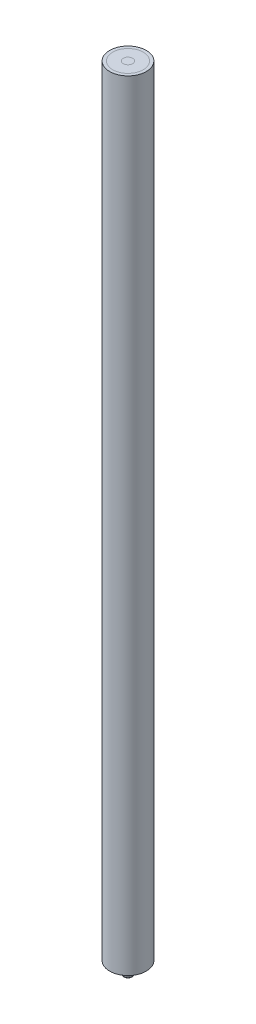
ISO-10303-21;
HEADER;
FILE_DESCRIPTION(('STEP AP214'),'2;1');
FILE_NAME('part.step','',(''),(''),'','','');
FILE_SCHEMA(('AUTOMOTIVE_DESIGN { 1 0 10303 214 1 1 1 1 }'));
ENDSEC;
DATA;
#1=APPLICATION_CONTEXT('core data for automotive mechanical design processes');
#2=APPLICATION_PROTOCOL_DEFINITION('international standard','automotive_design',2000,#1);
#3=PRODUCT_CONTEXT('',#1,'mechanical');
#4=PRODUCT('Part','Part','',(#3));
#5=PRODUCT_RELATED_PRODUCT_CATEGORY('part','',(#4));
#6=PRODUCT_DEFINITION_FORMATION('','',#4);
#7=PRODUCT_DEFINITION_CONTEXT('part definition',#1,'design');
#8=PRODUCT_DEFINITION('design','',#6,#7);
#9=PRODUCT_DEFINITION_SHAPE('','',#8);
#10=(LENGTH_UNIT() NAMED_UNIT(*) SI_UNIT(.MILLI.,.METRE.));
#11=(NAMED_UNIT(*) PLANE_ANGLE_UNIT() SI_UNIT($,.RADIAN.));
#12=(NAMED_UNIT(*) SI_UNIT($,.STERADIAN.) SOLID_ANGLE_UNIT());
#13=UNCERTAINTY_MEASURE_WITH_UNIT(LENGTH_MEASURE(1.E-05),#10,'distance_accuracy_value','');
#14=(GEOMETRIC_REPRESENTATION_CONTEXT(3) GLOBAL_UNCERTAINTY_ASSIGNED_CONTEXT((#13)) GLOBAL_UNIT_ASSIGNED_CONTEXT((#10,
#11,#12)) REPRESENTATION_CONTEXT('',''));
#15=CARTESIAN_POINT('',(0.,0.,0.));
#16=DIRECTION('',(0.,0.,1.));
#17=DIRECTION('',(1.,0.,0.));
#18=AXIS2_PLACEMENT_3D('',#15,#16,#17);
#19=CARTESIAN_POINT('',(0.,76.2,0.));
#20=DIRECTION('',(0.,1.,0.));
#21=DIRECTION('',(0.,0.,1.));
#22=AXIS2_PLACEMENT_3D('',#19,#20,#21);
#23=PLANE('',#22);
#24=CARTESIAN_POINT('',(0.,76.2,0.));
#25=DIRECTION('',(0.,1.,0.));
#26=DIRECTION('',(0.,0.,1.));
#27=AXIS2_PLACEMENT_3D('',#24,#25,#26);
#28=CIRCLE('',#27,1.7907);
#29=CARTESIAN_POINT('',(0.,76.2,1.7907));
#30=VERTEX_POINT('',#29);
#31=EDGE_CURVE('E11',#30,#30,#28,.T.);
#32=ORIENTED_EDGE('',*,*,#31,.T.);
#33=EDGE_LOOP('',(#32));
#34=FACE_BOUND('',#33,.T.);
#35=CARTESIAN_POINT('',(0.,76.2,0.));
#36=DIRECTION('',(0.,1.,0.));
#37=DIRECTION('',(0.,0.,1.));
#38=AXIS2_PLACEMENT_3D('',#35,#36,#37);
#39=CIRCLE('',#38,1.49225);
#40=CARTESIAN_POINT('',(0.,76.2,1.49225));
#41=VERTEX_POINT('',#40);
#42=EDGE_CURVE('E57',#41,#41,#39,.T.);
#43=ORIENTED_EDGE('',*,*,#42,.F.);
#44=EDGE_LOOP('',(#43));
#45=FACE_BOUND('',#44,.T.);
#46=ADVANCED_FACE('F46',(#34,#45),#23,.T.);
#47=CARTESIAN_POINT('',(0.,0.,0.));
#48=DIRECTION('',(0.,1.,0.));
#49=DIRECTION('',(0.,0.,1.));
#50=AXIS2_PLACEMENT_3D('',#47,#48,#49);
#51=PLANE('',#50);
#52=CARTESIAN_POINT('',(0.,0.,0.));
#53=DIRECTION('',(0.,1.,0.));
#54=DIRECTION('',(0.,0.,1.));
#55=AXIS2_PLACEMENT_3D('',#52,#53,#54);
#56=CIRCLE('',#55,1.7907);
#57=CARTESIAN_POINT('',(0.,0.,1.7907));
#58=VERTEX_POINT('',#57);
#59=EDGE_CURVE('E50',#58,#58,#56,.T.);
#60=ORIENTED_EDGE('',*,*,#59,.F.);
#61=EDGE_LOOP('',(#60));
#62=FACE_BOUND('',#61,.T.);
#63=CARTESIAN_POINT('',(0.,0.,0.));
#64=DIRECTION('',(0.,1.,0.));
#65=DIRECTION('',(0.,0.,1.));
#66=AXIS2_PLACEMENT_3D('',#63,#64,#65);
#67=CIRCLE('',#66,1.49225);
#68=CARTESIAN_POINT('',(0.,0.,1.49225));
#69=VERTEX_POINT('',#68);
#70=EDGE_CURVE('E59',#69,#69,#67,.T.);
#71=ORIENTED_EDGE('',*,*,#70,.T.);
#72=EDGE_LOOP('',(#71));
#73=FACE_BOUND('',#72,.T.);
#74=ADVANCED_FACE('F69',(#62,#73),#51,.F.);
#75=CARTESIAN_POINT('',(0.,76.2,0.));
#76=DIRECTION('',(0.,-1.,0.));
#77=DIRECTION('',(0.,0.,-1.));
#78=AXIS2_PLACEMENT_3D('',#75,#76,#77);
#79=CYLINDRICAL_SURFACE('',#78,1.7907);
#80=ORIENTED_EDGE('',*,*,#31,.F.);
#81=EDGE_LOOP('',(#80));
#82=FACE_BOUND('',#81,.T.);
#83=ORIENTED_EDGE('',*,*,#59,.T.);
#84=EDGE_LOOP('',(#83));
#85=FACE_BOUND('',#84,.T.);
#86=ADVANCED_FACE('F48',(#82,#85),#79,.T.);
#87=CARTESIAN_POINT('',(0.,76.2,0.));
#88=DIRECTION('',(0.,-1.,0.));
#89=DIRECTION('',(0.,0.,-1.));
#90=AXIS2_PLACEMENT_3D('',#87,#88,#89);
#91=CYLINDRICAL_SURFACE('',#90,1.49225);
#92=ORIENTED_EDGE('',*,*,#42,.T.);
#93=EDGE_LOOP('',(#92));
#94=FACE_BOUND('',#93,.T.);
#95=ORIENTED_EDGE('',*,*,#70,.F.);
#96=EDGE_LOOP('',(#95));
#97=FACE_BOUND('',#96,.T.);
#98=ADVANCED_FACE('F65',(#94,#97),#91,.F.);
#99=CLOSED_SHELL('',(#46,#74,#86,#98));
#100=MANIFOLD_SOLID_BREP('B2',#99);
#101=CARTESIAN_POINT('',(0.,76.2,0.));
#102=DIRECTION('',(0.,1.,0.));
#103=DIRECTION('',(0.,0.,1.));
#104=AXIS2_PLACEMENT_3D('',#101,#102,#103);
#105=PLANE('',#104);
#106=CARTESIAN_POINT('',(0.,76.2,0.));
#107=DIRECTION('',(0.,1.,0.));
#108=DIRECTION('',(0.,0.,1.));
#109=AXIS2_PLACEMENT_3D('',#106,#107,#108);
#110=CIRCLE('',#109,1.49225);
#111=CARTESIAN_POINT('',(0.,76.2,1.49225));
#112=VERTEX_POINT('',#111);
#113=EDGE_CURVE('E45',#112,#112,#110,.T.);
#114=ORIENTED_EDGE('',*,*,#113,.T.);
#115=EDGE_LOOP('',(#114));
#116=FACE_BOUND('',#115,.T.);
#117=CARTESIAN_POINT('',(0.,76.2,0.));
#118=DIRECTION('',(0.,1.,0.));
#119=DIRECTION('',(0.,0.,1.));
#120=AXIS2_PLACEMENT_3D('',#117,#118,#119);
#121=CIRCLE('',#120,0.45974);
#122=CARTESIAN_POINT('',(0.,76.2,0.45974));
#123=VERTEX_POINT('',#122);
#124=EDGE_CURVE('E126',#123,#123,#121,.T.);
#125=ORIENTED_EDGE('',*,*,#124,.F.);
#126=EDGE_LOOP('',(#125));
#127=FACE_BOUND('',#126,.T.);
#128=ADVANCED_FACE('F115',(#116,#127),#105,.T.);
#129=CARTESIAN_POINT('',(0.,0.,0.));
#130=DIRECTION('',(0.,1.,0.));
#131=DIRECTION('',(0.,0.,1.));
#132=AXIS2_PLACEMENT_3D('',#129,#130,#131);
#133=PLANE('',#132);
#134=CARTESIAN_POINT('',(0.,0.,0.));
#135=DIRECTION('',(0.,1.,0.));
#136=DIRECTION('',(0.,0.,1.));
#137=AXIS2_PLACEMENT_3D('',#134,#135,#136);
#138=CIRCLE('',#137,1.49225);
#139=CARTESIAN_POINT('',(0.,0.,1.49225));
#140=VERTEX_POINT('',#139);
#141=EDGE_CURVE('E119',#140,#140,#138,.T.);
#142=ORIENTED_EDGE('',*,*,#141,.F.);
#143=EDGE_LOOP('',(#142));
#144=FACE_BOUND('',#143,.T.);
#145=CARTESIAN_POINT('',(0.,0.,0.));
#146=DIRECTION('',(0.,1.,0.));
#147=DIRECTION('',(0.,0.,1.));
#148=AXIS2_PLACEMENT_3D('',#145,#146,#147);
#149=CIRCLE('',#148,0.45974);
#150=CARTESIAN_POINT('',(0.,0.,0.45974));
#151=VERTEX_POINT('',#150);
#152=EDGE_CURVE('E128',#151,#151,#149,.T.);
#153=ORIENTED_EDGE('',*,*,#152,.T.);
#154=EDGE_LOOP('',(#153));
#155=FACE_BOUND('',#154,.T.);
#156=ADVANCED_FACE('F138',(#144,#155),#133,.F.);
#157=CARTESIAN_POINT('',(0.,76.2,0.));
#158=DIRECTION('',(0.,-1.,0.));
#159=DIRECTION('',(0.,0.,-1.));
#160=AXIS2_PLACEMENT_3D('',#157,#158,#159);
#161=CYLINDRICAL_SURFACE('',#160,1.49225);
#162=ORIENTED_EDGE('',*,*,#113,.F.);
#163=EDGE_LOOP('',(#162));
#164=FACE_BOUND('',#163,.T.);
#165=ORIENTED_EDGE('',*,*,#141,.T.);
#166=EDGE_LOOP('',(#165));
#167=FACE_BOUND('',#166,.T.);
#168=ADVANCED_FACE('F117',(#164,#167),#161,.T.);
#169=CARTESIAN_POINT('',(0.,76.2,0.));
#170=DIRECTION('',(0.,-1.,0.));
#171=DIRECTION('',(0.,0.,-1.));
#172=AXIS2_PLACEMENT_3D('',#169,#170,#171);
#173=CYLINDRICAL_SURFACE('',#172,0.45974);
#174=ORIENTED_EDGE('',*,*,#124,.T.);
#175=EDGE_LOOP('',(#174));
#176=FACE_BOUND('',#175,.T.);
#177=ORIENTED_EDGE('',*,*,#152,.F.);
#178=EDGE_LOOP('',(#177));
#179=FACE_BOUND('',#178,.T.);
#180=ADVANCED_FACE('F134',(#176,#179),#173,.F.);
#181=CLOSED_SHELL('',(#128,#156,#168,#180));
#182=MANIFOLD_SOLID_BREP('B6',#181);
#183=CARTESIAN_POINT('',(0.,-1.27,0.));
#184=DIRECTION('',(0.,1.,0.));
#185=DIRECTION('',(0.,0.,1.));
#186=AXIS2_PLACEMENT_3D('',#183,#184,#185);
#187=CYLINDRICAL_SURFACE('',#186,0.45974);
#188=CARTESIAN_POINT('',(0.,-1.016,0.));
#189=DIRECTION('',(0.,1.,0.));
#190=DIRECTION('',(0.,0.,1.));
#191=AXIS2_PLACEMENT_3D('',#188,#189,#190);
#192=CIRCLE('',#191,0.45974);
#193=CARTESIAN_POINT('',(0.,-1.016,0.45974));
#194=VERTEX_POINT('',#193);
#195=EDGE_CURVE('E184',#194,#194,#192,.T.);
#196=ORIENTED_EDGE('',*,*,#195,.T.);
#197=EDGE_LOOP('',(#196));
#198=FACE_BOUND('',#197,.T.);
#199=CARTESIAN_POINT('',(0.,76.2,0.));
#200=DIRECTION('',(0.,1.,0.));
#201=DIRECTION('',(0.,0.,1.));
#202=AXIS2_PLACEMENT_3D('',#199,#200,#201);
#203=CIRCLE('',#202,0.45974);
#204=CARTESIAN_POINT('',(0.,76.2,0.45974));
#205=VERTEX_POINT('',#204);
#206=EDGE_CURVE('E188',#205,#205,#203,.T.);
#207=ORIENTED_EDGE('',*,*,#206,.F.);
#208=EDGE_LOOP('',(#207));
#209=FACE_BOUND('',#208,.T.);
#210=ADVANCED_FACE('F177',(#198,#209),#187,.T.);
#211=CARTESIAN_POINT('',(0.,-1.27,0.));
#212=DIRECTION('',(0.,1.,0.));
#213=DIRECTION('',(0.,0.,1.));
#214=AXIS2_PLACEMENT_3D('',#211,#212,#213);
#215=PLANE('',#214);
#216=CARTESIAN_POINT('',(0.,-1.27,0.));
#217=DIRECTION('',(0.,1.,0.));
#218=DIRECTION('',(0.,0.,1.));
#219=AXIS2_PLACEMENT_3D('',#216,#217,#218);
#220=CIRCLE('',#219,0.20574);
#221=CARTESIAN_POINT('',(0.,-1.27,0.20574));
#222=VERTEX_POINT('',#221);
#223=EDGE_CURVE('E114',#222,#222,#220,.F.);
#224=ORIENTED_EDGE('',*,*,#223,.T.);
#225=EDGE_LOOP('',(#224));
#226=FACE_BOUND('',#225,.T.);
#227=ADVANCED_FACE('F198',(#226),#215,.F.);
#228=CARTESIAN_POINT('',(0.,76.2,0.));
#229=DIRECTION('',(0.,1.,0.));
#230=DIRECTION('',(0.,0.,1.));
#231=AXIS2_PLACEMENT_3D('',#228,#229,#230);
#232=PLANE('',#231);
#233=ORIENTED_EDGE('',*,*,#206,.T.);
#234=EDGE_LOOP('',(#233));
#235=FACE_BOUND('',#234,.T.);
#236=ADVANCED_FACE('F195',(#235),#232,.T.);
#237=CARTESIAN_POINT('',(0.,-1.016,0.));
#238=DIRECTION('',(0.,1.,0.));
#239=DIRECTION('',(0.,0.,1.));
#240=AXIS2_PLACEMENT_3D('',#237,#238,#239);
#241=DEGENERATE_TOROIDAL_SURFACE('',#240,0.20574,0.254,.T.);
#242=ORIENTED_EDGE('',*,*,#223,.F.);
#243=EDGE_LOOP('',(#242));
#244=FACE_BOUND('',#243,.T.);
#245=ORIENTED_EDGE('',*,*,#195,.F.);
#246=EDGE_LOOP('',(#245));
#247=FACE_BOUND('',#246,.T.);
#248=ADVANCED_FACE('F179',(#244,#247),#241,.T.);
#249=CLOSED_SHELL('',(#210,#227,#236,#248));
#250=MANIFOLD_SOLID_BREP('B40',#249);
#251=ADVANCED_BREP_SHAPE_REPRESENTATION('',(#18,#100,#182,#250),#14);
#252=SHAPE_DEFINITION_REPRESENTATION(#9,#251);
ENDSEC;
END-ISO-10303-21;
